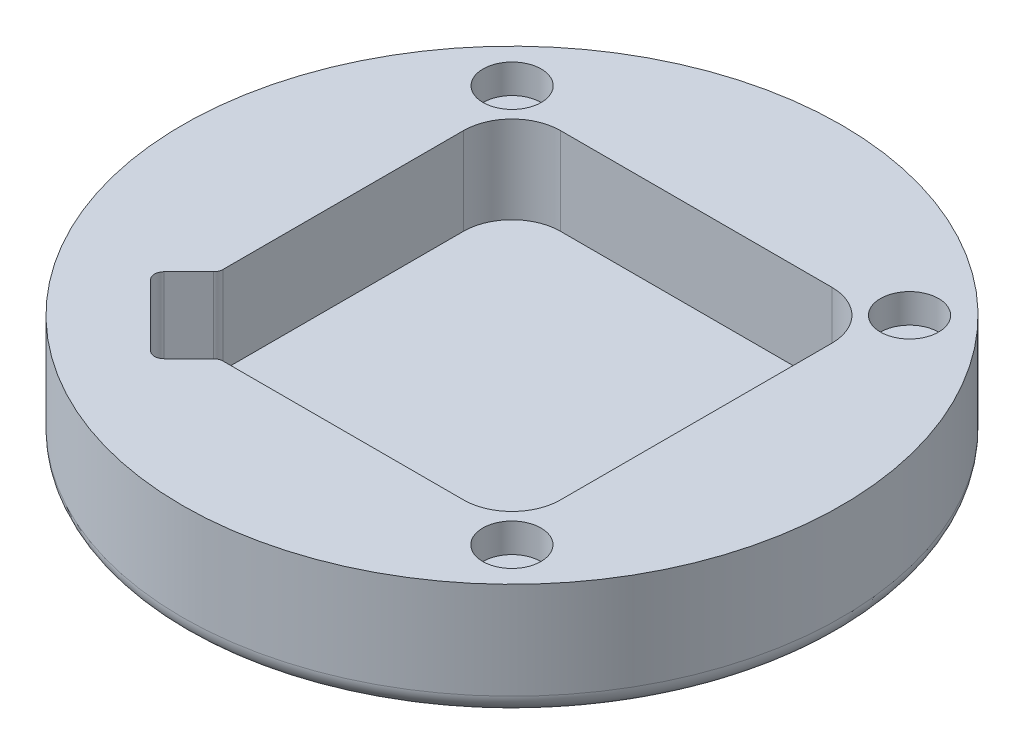
ISO-10303-21;
HEADER;
FILE_DESCRIPTION(('STEP AP214'),'2;1');
FILE_NAME('part.step','',(''),(''),'','','');
FILE_SCHEMA(('AUTOMOTIVE_DESIGN { 1 0 10303 214 1 1 1 1 }'));
ENDSEC;
DATA;
#1=APPLICATION_CONTEXT('core data for automotive mechanical design processes');
#2=APPLICATION_PROTOCOL_DEFINITION('international standard','automotive_design',2000,#1);
#3=PRODUCT_CONTEXT('',#1,'mechanical');
#4=PRODUCT('Part','Part','',(#3));
#5=PRODUCT_RELATED_PRODUCT_CATEGORY('part','',(#4));
#6=PRODUCT_DEFINITION_FORMATION('','',#4);
#7=PRODUCT_DEFINITION_CONTEXT('part definition',#1,'design');
#8=PRODUCT_DEFINITION('design','',#6,#7);
#9=PRODUCT_DEFINITION_SHAPE('','',#8);
#10=(LENGTH_UNIT() NAMED_UNIT(*) SI_UNIT(.MILLI.,.METRE.));
#11=(NAMED_UNIT(*) PLANE_ANGLE_UNIT() SI_UNIT($,.RADIAN.));
#12=(NAMED_UNIT(*) SI_UNIT($,.STERADIAN.) SOLID_ANGLE_UNIT());
#13=UNCERTAINTY_MEASURE_WITH_UNIT(LENGTH_MEASURE(1.E-05),#10,'distance_accuracy_value','');
#14=(GEOMETRIC_REPRESENTATION_CONTEXT(3) GLOBAL_UNCERTAINTY_ASSIGNED_CONTEXT((#13)) GLOBAL_UNIT_ASSIGNED_CONTEXT((#10,
#11,#12)) REPRESENTATION_CONTEXT('',''));
#15=CARTESIAN_POINT('',(0.,0.,0.));
#16=DIRECTION('',(0.,0.,1.));
#17=DIRECTION('',(1.,0.,0.));
#18=AXIS2_PLACEMENT_3D('',#15,#16,#17);
#19=CARTESIAN_POINT('',(0.,3.,0.));
#20=DIRECTION('',(0.,-1.,0.));
#21=DIRECTION('',(0.,0.,-1.));
#22=AXIS2_PLACEMENT_3D('',#19,#20,#21);
#23=CYLINDRICAL_SURFACE('',#22,34.);
#24=CARTESIAN_POINT('',(0.,2.,0.));
#25=DIRECTION('',(0.,1.,0.));
#26=DIRECTION('',(0.,0.,1.));
#27=AXIS2_PLACEMENT_3D('',#24,#25,#26);
#28=CIRCLE('',#27,34.);
#29=CARTESIAN_POINT('',(0.,2.,34.));
#30=VERTEX_POINT('',#29);
#31=EDGE_CURVE('E51',#30,#30,#28,.T.);
#32=ORIENTED_EDGE('',*,*,#31,.T.);
#33=EDGE_LOOP('',(#32));
#34=FACE_BOUND('',#33,.T.);
#35=CARTESIAN_POINT('',(0.,12.,0.));
#36=DIRECTION('',(0.,1.,0.));
#37=DIRECTION('',(0.,0.,1.));
#38=AXIS2_PLACEMENT_3D('',#35,#36,#37);
#39=CIRCLE('',#38,34.);
#40=CARTESIAN_POINT('',(0.,12.,34.));
#41=VERTEX_POINT('',#40);
#42=EDGE_CURVE('E178',#41,#41,#39,.T.);
#43=ORIENTED_EDGE('',*,*,#42,.F.);
#44=EDGE_LOOP('',(#43));
#45=FACE_BOUND('',#44,.T.);
#46=ADVANCED_FACE('F42',(#34,#45),#23,.T.);
#47=CARTESIAN_POINT('',(0.,0.,0.));
#48=DIRECTION('',(0.,1.,0.));
#49=DIRECTION('',(0.,0.,1.));
#50=AXIS2_PLACEMENT_3D('',#47,#48,#49);
#51=PLANE('',#50);
#52=CARTESIAN_POINT('',(0.,0.,0.));
#53=DIRECTION('',(0.,1.,0.));
#54=DIRECTION('',(0.,0.,1.));
#55=AXIS2_PLACEMENT_3D('',#52,#53,#54);
#56=CIRCLE('',#55,32.);
#57=CARTESIAN_POINT('',(0.,0.,32.));
#58=VERTEX_POINT('',#57);
#59=EDGE_CURVE('E11',#58,#58,#56,.F.);
#60=ORIENTED_EDGE('',*,*,#59,.T.);
#61=EDGE_LOOP('',(#60));
#62=FACE_BOUND('',#61,.T.);
#63=ADVANCED_FACE('F275',(#62),#51,.F.);
#64=CARTESIAN_POINT('',(0.,12.,0.));
#65=DIRECTION('',(0.,1.,0.));
#66=DIRECTION('',(0.,0.,1.));
#67=AXIS2_PLACEMENT_3D('',#64,#65,#66);
#68=PLANE('',#67);
#69=DIRECTION('',(-0.707106781186551,0.,0.707106781186543));
#70=VECTOR('',#69,1.);
#71=CARTESIAN_POINT('',(-19.,12.,11.2218254069479));
#72=LINE('',#71,#70);
#73=CARTESIAN_POINT('',(-19.2928932188135,12.,11.5147186257614));
#74=VERTEX_POINT('',#73);
#75=CARTESIAN_POINT('',(-21.8284271247462,12.,14.0502525316941));
#76=VERTEX_POINT('',#75);
#77=EDGE_CURVE('E332',#74,#76,#72,.T.);
#78=ORIENTED_EDGE('',*,*,#77,.F.);
#79=CARTESIAN_POINT('',(-20.,12.,10.8076118445748));
#80=DIRECTION('',(0.,1.,0.));
#81=DIRECTION('',(0.,0.,1.));
#82=AXIS2_PLACEMENT_3D('',#79,#80,#81);
#83=CIRCLE('',#82,1.);
#84=CARTESIAN_POINT('',(-19.,12.,10.8076118445748));
#85=VERTEX_POINT('',#84);
#86=EDGE_CURVE('E222',#74,#85,#83,.T.);
#87=ORIENTED_EDGE('',*,*,#86,.T.);
#88=DIRECTION('',(0.,0.,1.));
#89=VECTOR('',#88,1.);
#90=CARTESIAN_POINT('',(-19.,12.,19.));
#91=LINE('',#90,#89);
#92=CARTESIAN_POINT('',(-19.,12.,-14.));
#93=VERTEX_POINT('',#92);
#94=EDGE_CURVE('E369',#93,#85,#91,.T.);
#95=ORIENTED_EDGE('',*,*,#94,.F.);
#96=CARTESIAN_POINT('',(-14.,12.,-14.));
#97=DIRECTION('',(0.,1.,0.));
#98=DIRECTION('',(0.,0.,1.));
#99=AXIS2_PLACEMENT_3D('',#96,#97,#98);
#100=CIRCLE('',#99,5.);
#101=CARTESIAN_POINT('',(-14.,12.,-19.));
#102=VERTEX_POINT('',#101);
#103=EDGE_CURVE('E209',#93,#102,#100,.F.);
#104=ORIENTED_EDGE('',*,*,#103,.T.);
#105=DIRECTION('',(-1.,0.,0.));
#106=VECTOR('',#105,1.);
#107=CARTESIAN_POINT('',(-19.,12.,-19.));
#108=LINE('',#107,#106);
#109=CARTESIAN_POINT('',(14.,12.,-19.));
#110=VERTEX_POINT('',#109);
#111=EDGE_CURVE('E365',#110,#102,#108,.T.);
#112=ORIENTED_EDGE('',*,*,#111,.F.);
#113=CARTESIAN_POINT('',(14.,12.,-14.));
#114=DIRECTION('',(0.,1.,0.));
#115=DIRECTION('',(0.,0.,1.));
#116=AXIS2_PLACEMENT_3D('',#113,#114,#115);
#117=CIRCLE('',#116,5.);
#118=CARTESIAN_POINT('',(19.,12.,-14.));
#119=VERTEX_POINT('',#118);
#120=EDGE_CURVE('E206',#110,#119,#117,.F.);
#121=ORIENTED_EDGE('',*,*,#120,.T.);
#122=DIRECTION('',(0.,0.,-1.));
#123=VECTOR('',#122,1.);
#124=CARTESIAN_POINT('',(19.,12.,19.));
#125=LINE('',#124,#123);
#126=CARTESIAN_POINT('',(19.,12.,14.));
#127=VERTEX_POINT('',#126);
#128=EDGE_CURVE('E158',#127,#119,#125,.T.);
#129=ORIENTED_EDGE('',*,*,#128,.F.);
#130=CARTESIAN_POINT('',(14.,12.,14.));
#131=DIRECTION('',(0.,1.,0.));
#132=DIRECTION('',(0.,0.,1.));
#133=AXIS2_PLACEMENT_3D('',#130,#131,#132);
#134=CIRCLE('',#133,5.);
#135=CARTESIAN_POINT('',(14.,12.,19.));
#136=VERTEX_POINT('',#135);
#137=EDGE_CURVE('E203',#127,#136,#134,.F.);
#138=ORIENTED_EDGE('',*,*,#137,.T.);
#139=DIRECTION('',(1.,0.,0.));
#140=VECTOR('',#139,1.);
#141=CARTESIAN_POINT('',(-19.,12.,19.));
#142=LINE('',#141,#140);
#143=CARTESIAN_POINT('',(-10.8076118445749,12.,19.));
#144=VERTEX_POINT('',#143);
#145=EDGE_CURVE('E174',#144,#136,#142,.T.);
#146=ORIENTED_EDGE('',*,*,#145,.F.);
#147=CARTESIAN_POINT('',(-10.8076118445749,12.,20.));
#148=DIRECTION('',(0.,1.,0.));
#149=DIRECTION('',(0.,0.,1.));
#150=AXIS2_PLACEMENT_3D('',#147,#148,#149);
#151=CIRCLE('',#150,1.);
#152=CARTESIAN_POINT('',(-11.5147186257615,12.,19.2928932188134));
#153=VERTEX_POINT('',#152);
#154=EDGE_CURVE('E219',#144,#153,#151,.T.);
#155=ORIENTED_EDGE('',*,*,#154,.T.);
#156=DIRECTION('',(0.707106781186551,0.,-0.707106781186544));
#157=VECTOR('',#156,1.);
#158=CARTESIAN_POINT('',(-14.7573593128808,12.,22.5355339059327));
#159=LINE('',#158,#157);
#160=CARTESIAN_POINT('',(-14.0502525316942,12.,21.8284271247462));
#161=VERTEX_POINT('',#160);
#162=EDGE_CURVE('E339',#161,#153,#159,.T.);
#163=ORIENTED_EDGE('',*,*,#162,.F.);
#164=CARTESIAN_POINT('',(-14.7573593128808,12.,21.1213203435596));
#165=DIRECTION('',(0.,1.,0.));
#166=DIRECTION('',(0.,0.,1.));
#167=AXIS2_PLACEMENT_3D('',#164,#165,#166);
#168=CIRCLE('',#167,1.);
#169=CARTESIAN_POINT('',(-15.4644660940673,12.,21.8284271247462));
#170=VERTEX_POINT('',#169);
#171=EDGE_CURVE('E254',#161,#170,#168,.F.);
#172=ORIENTED_EDGE('',*,*,#171,.T.);
#173=DIRECTION('',(0.707106781186543,0.,0.707106781186552));
#174=VECTOR('',#173,1.);
#175=CARTESIAN_POINT('',(-17.1393577862369,12.,20.1535354325766));
#176=LINE('',#175,#174);
#177=CARTESIAN_POINT('',(-21.8284271247462,12.,15.4644660940672));
#178=VERTEX_POINT('',#177);
#179=EDGE_CURVE('E336',#178,#170,#176,.T.);
#180=ORIENTED_EDGE('',*,*,#179,.F.);
#181=CARTESIAN_POINT('',(-21.1213203435597,12.,14.7573593128807));
#182=DIRECTION('',(0.,1.,0.));
#183=DIRECTION('',(0.,0.,1.));
#184=AXIS2_PLACEMENT_3D('',#181,#182,#183);
#185=CIRCLE('',#184,1.);
#186=EDGE_CURVE('E257',#178,#76,#185,.F.);
#187=ORIENTED_EDGE('',*,*,#186,.T.);
#188=EDGE_LOOP('',(#78,#87,#95,#104,#112,#121,#129,#138,#146,#155,#163,#172,#180,#187));
#189=FACE_BOUND('',#188,.T.);
#190=CARTESIAN_POINT('',(-20.5,12.,-20.512191496766));
#191=DIRECTION('',(0.,1.,0.));
#192=DIRECTION('',(0.,0.,1.));
#193=AXIS2_PLACEMENT_3D('',#190,#191,#192);
#194=CIRCLE('',#193,3.);
#195=CARTESIAN_POINT('',(-20.5,12.,-17.512191496766));
#196=VERTEX_POINT('',#195);
#197=EDGE_CURVE('E347',#196,#196,#194,.T.);
#198=ORIENTED_EDGE('',*,*,#197,.F.);
#199=EDGE_LOOP('',(#198));
#200=FACE_BOUND('',#199,.T.);
#201=CARTESIAN_POINT('',(20.512191496766,12.,-20.5000000000017));
#202=DIRECTION('',(0.,1.,0.));
#203=DIRECTION('',(0.,0.,1.));
#204=AXIS2_PLACEMENT_3D('',#201,#202,#203);
#205=CIRCLE('',#204,3.00000000000175);
#206=CARTESIAN_POINT('',(20.512191496766,12.,-17.5));
#207=VERTEX_POINT('',#206);
#208=EDGE_CURVE('E351',#207,#207,#205,.T.);
#209=ORIENTED_EDGE('',*,*,#208,.F.);
#210=EDGE_LOOP('',(#209));
#211=FACE_BOUND('',#210,.T.);
#212=CARTESIAN_POINT('',(20.5000000000017,12.,20.5121914967643));
#213=DIRECTION('',(0.,1.,0.));
#214=DIRECTION('',(0.,0.,1.));
#215=AXIS2_PLACEMENT_3D('',#212,#213,#214);
#216=CIRCLE('',#215,3.00000000000235);
#217=CARTESIAN_POINT('',(20.5000000000017,12.,23.5121914967666));
#218=VERTEX_POINT('',#217);
#219=EDGE_CURVE('E326',#218,#218,#216,.T.);
#220=ORIENTED_EDGE('',*,*,#219,.F.);
#221=EDGE_LOOP('',(#220));
#222=FACE_BOUND('',#221,.T.);
#223=ORIENTED_EDGE('',*,*,#42,.T.);
#224=EDGE_LOOP('',(#223));
#225=FACE_BOUND('',#224,.T.);
#226=ADVANCED_FACE('F281',(#189,#200,#211,#222,#225),#68,.T.);
#227=CARTESIAN_POINT('',(19.,12.,19.));
#228=DIRECTION('',(-1.,0.,0.));
#229=DIRECTION('',(0.,0.,1.));
#230=AXIS2_PLACEMENT_3D('',#227,#228,#229);
#231=PLANE('',#230);
#232=DIRECTION('',(0.,0.,-1.));
#233=VECTOR('',#232,1.);
#234=CARTESIAN_POINT('',(19.,3.,19.));
#235=LINE('',#234,#233);
#236=CARTESIAN_POINT('',(19.,3.,14.));
#237=VERTEX_POINT('',#236);
#238=CARTESIAN_POINT('',(19.,3.,-14.));
#239=VERTEX_POINT('',#238);
#240=EDGE_CURVE('E346',#237,#239,#235,.T.);
#241=ORIENTED_EDGE('',*,*,#240,.F.);
#242=DIRECTION('',(0.,-1.,0.));
#243=VECTOR('',#242,1.);
#244=CARTESIAN_POINT('',(19.,12.,14.));
#245=LINE('',#244,#243);
#246=EDGE_CURVE('E167',#237,#127,#245,.F.);
#247=ORIENTED_EDGE('',*,*,#246,.T.);
#248=ORIENTED_EDGE('',*,*,#128,.T.);
#249=DIRECTION('',(0.,-1.,0.));
#250=VECTOR('',#249,1.);
#251=CARTESIAN_POINT('',(19.,3.,-14.));
#252=LINE('',#251,#250);
#253=EDGE_CURVE('E169',#119,#239,#252,.T.);
#254=ORIENTED_EDGE('',*,*,#253,.T.);
#255=EDGE_LOOP('',(#241,#247,#248,#254));
#256=FACE_BOUND('',#255,.T.);
#257=ADVANCED_FACE('F439',(#256),#231,.T.);
#258=CARTESIAN_POINT('',(-19.,12.,-19.));
#259=DIRECTION('',(0.,0.,1.));
#260=DIRECTION('',(1.,0.,0.));
#261=AXIS2_PLACEMENT_3D('',#258,#259,#260);
#262=PLANE('',#261);
#263=DIRECTION('',(-1.,0.,0.));
#264=VECTOR('',#263,1.);
#265=CARTESIAN_POINT('',(-19.,3.,-19.));
#266=LINE('',#265,#264);
#267=CARTESIAN_POINT('',(14.,3.,-19.));
#268=VERTEX_POINT('',#267);
#269=CARTESIAN_POINT('',(-14.,3.,-19.));
#270=VERTEX_POINT('',#269);
#271=EDGE_CURVE('E377',#268,#270,#266,.T.);
#272=ORIENTED_EDGE('',*,*,#271,.F.);
#273=DIRECTION('',(0.,-1.,0.));
#274=VECTOR('',#273,1.);
#275=CARTESIAN_POINT('',(14.,12.,-19.));
#276=LINE('',#275,#274);
#277=EDGE_CURVE('E200',#268,#110,#276,.F.);
#278=ORIENTED_EDGE('',*,*,#277,.T.);
#279=ORIENTED_EDGE('',*,*,#111,.T.);
#280=DIRECTION('',(0.,-1.,0.));
#281=VECTOR('',#280,1.);
#282=CARTESIAN_POINT('',(-14.,3.,-19.));
#283=LINE('',#282,#281);
#284=EDGE_CURVE('E196',#102,#270,#283,.T.);
#285=ORIENTED_EDGE('',*,*,#284,.T.);
#286=EDGE_LOOP('',(#272,#278,#279,#285));
#287=FACE_BOUND('',#286,.T.);
#288=ADVANCED_FACE('F436',(#287),#262,.T.);
#289=CARTESIAN_POINT('',(-19.,12.,19.));
#290=DIRECTION('',(1.,0.,0.));
#291=DIRECTION('',(0.,0.,-1.));
#292=AXIS2_PLACEMENT_3D('',#289,#290,#291);
#293=PLANE('',#292);
#294=ORIENTED_EDGE('',*,*,#94,.T.);
#295=DIRECTION('',(0.,1.,0.));
#296=VECTOR('',#295,1.);
#297=CARTESIAN_POINT('',(-19.,3.,10.8076118445748));
#298=LINE('',#297,#296);
#299=CARTESIAN_POINT('',(-19.,3.,10.8076118445748));
#300=VERTEX_POINT('',#299);
#301=EDGE_CURVE('E225',#85,#300,#298,.F.);
#302=ORIENTED_EDGE('',*,*,#301,.T.);
#303=DIRECTION('',(0.,0.,1.));
#304=VECTOR('',#303,1.);
#305=CARTESIAN_POINT('',(-19.,3.,19.));
#306=LINE('',#305,#304);
#307=CARTESIAN_POINT('',(-19.,3.,-14.));
#308=VERTEX_POINT('',#307);
#309=EDGE_CURVE('E159',#308,#300,#306,.T.);
#310=ORIENTED_EDGE('',*,*,#309,.F.);
#311=DIRECTION('',(0.,-1.,0.));
#312=VECTOR('',#311,1.);
#313=CARTESIAN_POINT('',(-19.,12.,-14.));
#314=LINE('',#313,#312);
#315=EDGE_CURVE('E193',#308,#93,#314,.F.);
#316=ORIENTED_EDGE('',*,*,#315,.T.);
#317=EDGE_LOOP('',(#294,#302,#310,#316));
#318=FACE_BOUND('',#317,.T.);
#319=ADVANCED_FACE('F433',(#318),#293,.T.);
#320=CARTESIAN_POINT('',(-19.,12.,19.));
#321=DIRECTION('',(0.,0.,-1.));
#322=DIRECTION('',(-1.,0.,0.));
#323=AXIS2_PLACEMENT_3D('',#320,#321,#322);
#324=PLANE('',#323);
#325=DIRECTION('',(1.,0.,0.));
#326=VECTOR('',#325,1.);
#327=CARTESIAN_POINT('',(-19.,3.,19.));
#328=LINE('',#327,#326);
#329=CARTESIAN_POINT('',(-10.8076118445749,3.,19.));
#330=VERTEX_POINT('',#329);
#331=CARTESIAN_POINT('',(14.,3.,19.));
#332=VERTEX_POINT('',#331);
#333=EDGE_CURVE('E144',#330,#332,#328,.T.);
#334=ORIENTED_EDGE('',*,*,#333,.F.);
#335=DIRECTION('',(0.,1.,0.));
#336=VECTOR('',#335,1.);
#337=CARTESIAN_POINT('',(-10.8076118445749,12.,19.));
#338=LINE('',#337,#336);
#339=EDGE_CURVE('E228',#330,#144,#338,.T.);
#340=ORIENTED_EDGE('',*,*,#339,.T.);
#341=ORIENTED_EDGE('',*,*,#145,.T.);
#342=DIRECTION('',(0.,-1.,0.));
#343=VECTOR('',#342,1.);
#344=CARTESIAN_POINT('',(14.,3.,19.));
#345=LINE('',#344,#343);
#346=EDGE_CURVE('E166',#136,#332,#345,.T.);
#347=ORIENTED_EDGE('',*,*,#346,.T.);
#348=EDGE_LOOP('',(#334,#340,#341,#347));
#349=FACE_BOUND('',#348,.T.);
#350=ADVANCED_FACE('F172',(#349),#324,.T.);
#351=CARTESIAN_POINT('',(0.,3.,0.));
#352=DIRECTION('',(0.,1.,0.));
#353=DIRECTION('',(0.,0.,1.));
#354=AXIS2_PLACEMENT_3D('',#351,#352,#353);
#355=PLANE('',#354);
#356=DIRECTION('',(0.707106781186544,0.,0.707106781186551));
#357=VECTOR('',#356,1.);
#358=CARTESIAN_POINT('',(-22.5355339059328,3.,14.7573593128807));
#359=LINE('',#358,#357);
#360=CARTESIAN_POINT('',(-21.8284271247462,3.,15.4644660940672));
#361=VERTEX_POINT('',#360);
#362=CARTESIAN_POINT('',(-15.4644660940673,3.,21.8284271247462));
#363=VERTEX_POINT('',#362);
#364=EDGE_CURVE('E314',#361,#363,#359,.T.);
#365=ORIENTED_EDGE('',*,*,#364,.T.);
#366=CARTESIAN_POINT('',(-14.7573593128808,3.,21.1213203435596));
#367=DIRECTION('',(0.,1.,0.));
#368=DIRECTION('',(0.,0.,1.));
#369=AXIS2_PLACEMENT_3D('',#366,#367,#368);
#370=CIRCLE('',#369,1.);
#371=CARTESIAN_POINT('',(-14.0502525316942,3.,21.8284271247462));
#372=VERTEX_POINT('',#371);
#373=EDGE_CURVE('E246',#363,#372,#370,.T.);
#374=ORIENTED_EDGE('',*,*,#373,.T.);
#375=DIRECTION('',(0.707106781186551,0.,-0.707106781186544));
#376=VECTOR('',#375,1.);
#377=CARTESIAN_POINT('',(-14.7573593128808,3.,22.5355339059327));
#378=LINE('',#377,#376);
#379=CARTESIAN_POINT('',(-11.5147186257615,3.,19.2928932188134));
#380=VERTEX_POINT('',#379);
#381=EDGE_CURVE('E313',#372,#380,#378,.T.);
#382=ORIENTED_EDGE('',*,*,#381,.T.);
#383=CARTESIAN_POINT('',(-10.8076118445749,3.,20.));
#384=DIRECTION('',(0.,1.,0.));
#385=DIRECTION('',(0.,0.,1.));
#386=AXIS2_PLACEMENT_3D('',#383,#384,#385);
#387=CIRCLE('',#386,1.);
#388=EDGE_CURVE('E152',#380,#330,#387,.F.);
#389=ORIENTED_EDGE('',*,*,#388,.T.);
#390=ORIENTED_EDGE('',*,*,#333,.T.);
#391=CARTESIAN_POINT('',(14.,3.,14.));
#392=DIRECTION('',(0.,1.,0.));
#393=DIRECTION('',(0.,0.,1.));
#394=AXIS2_PLACEMENT_3D('',#391,#392,#393);
#395=CIRCLE('',#394,5.);
#396=EDGE_CURVE('E148',#332,#237,#395,.T.);
#397=ORIENTED_EDGE('',*,*,#396,.T.);
#398=ORIENTED_EDGE('',*,*,#240,.T.);
#399=CARTESIAN_POINT('',(14.,3.,-14.));
#400=DIRECTION('',(0.,1.,0.));
#401=DIRECTION('',(0.,0.,1.));
#402=AXIS2_PLACEMENT_3D('',#399,#400,#401);
#403=CIRCLE('',#402,5.);
#404=EDGE_CURVE('E170',#239,#268,#403,.T.);
#405=ORIENTED_EDGE('',*,*,#404,.T.);
#406=ORIENTED_EDGE('',*,*,#271,.T.);
#407=CARTESIAN_POINT('',(-14.,3.,-14.));
#408=DIRECTION('',(0.,1.,0.));
#409=DIRECTION('',(0.,0.,1.));
#410=AXIS2_PLACEMENT_3D('',#407,#408,#409);
#411=CIRCLE('',#410,5.);
#412=EDGE_CURVE('E177',#270,#308,#411,.T.);
#413=ORIENTED_EDGE('',*,*,#412,.T.);
#414=ORIENTED_EDGE('',*,*,#309,.T.);
#415=CARTESIAN_POINT('',(-20.,3.,10.8076118445748));
#416=DIRECTION('',(0.,1.,0.));
#417=DIRECTION('',(0.,0.,1.));
#418=AXIS2_PLACEMENT_3D('',#415,#416,#417);
#419=CIRCLE('',#418,1.);
#420=CARTESIAN_POINT('',(-19.2928932188135,3.,11.5147186257614));
#421=VERTEX_POINT('',#420);
#422=EDGE_CURVE('E249',#300,#421,#419,.F.);
#423=ORIENTED_EDGE('',*,*,#422,.T.);
#424=DIRECTION('',(-0.707106781186551,0.,0.707106781186543));
#425=VECTOR('',#424,1.);
#426=CARTESIAN_POINT('',(-19.,3.,11.2218254069479));
#427=LINE('',#426,#425);
#428=CARTESIAN_POINT('',(-21.8284271247462,3.,14.0502525316941));
#429=VERTEX_POINT('',#428);
#430=EDGE_CURVE('E328',#421,#429,#427,.T.);
#431=ORIENTED_EDGE('',*,*,#430,.T.);
#432=CARTESIAN_POINT('',(-21.1213203435597,3.,14.7573593128807));
#433=DIRECTION('',(0.,1.,0.));
#434=DIRECTION('',(0.,0.,1.));
#435=AXIS2_PLACEMENT_3D('',#432,#433,#434);
#436=CIRCLE('',#435,1.);
#437=EDGE_CURVE('E65',#429,#361,#436,.T.);
#438=ORIENTED_EDGE('',*,*,#437,.T.);
#439=EDGE_LOOP('',(#365,#374,#382,#389,#390,#397,#398,#405,#406,#413,#414,#423,#431,#438));
#440=FACE_BOUND('',#439,.T.);
#441=ADVANCED_FACE('F146',(#440),#355,.T.);
#442=CARTESIAN_POINT('',(14.,12.,14.));
#443=DIRECTION('',(0.,1.,0.));
#444=DIRECTION('',(0.,0.,1.));
#445=AXIS2_PLACEMENT_3D('',#442,#443,#444);
#446=CYLINDRICAL_SURFACE('',#445,5.);
#447=ORIENTED_EDGE('',*,*,#137,.F.);
#448=ORIENTED_EDGE('',*,*,#246,.F.);
#449=ORIENTED_EDGE('',*,*,#396,.F.);
#450=ORIENTED_EDGE('',*,*,#346,.F.);
#451=EDGE_LOOP('',(#447,#448,#449,#450));
#452=FACE_BOUND('',#451,.T.);
#453=ADVANCED_FACE('F165',(#452),#446,.F.);
#454=CARTESIAN_POINT('',(14.,12.,-14.));
#455=DIRECTION('',(0.,1.,0.));
#456=DIRECTION('',(0.,0.,1.));
#457=AXIS2_PLACEMENT_3D('',#454,#455,#456);
#458=CYLINDRICAL_SURFACE('',#457,5.);
#459=ORIENTED_EDGE('',*,*,#120,.F.);
#460=ORIENTED_EDGE('',*,*,#277,.F.);
#461=ORIENTED_EDGE('',*,*,#404,.F.);
#462=ORIENTED_EDGE('',*,*,#253,.F.);
#463=EDGE_LOOP('',(#459,#460,#461,#462));
#464=FACE_BOUND('',#463,.T.);
#465=ADVANCED_FACE('F288',(#464),#458,.F.);
#466=CARTESIAN_POINT('',(-14.,12.,-14.));
#467=DIRECTION('',(0.,1.,0.));
#468=DIRECTION('',(0.,0.,1.));
#469=AXIS2_PLACEMENT_3D('',#466,#467,#468);
#470=CYLINDRICAL_SURFACE('',#469,5.);
#471=ORIENTED_EDGE('',*,*,#103,.F.);
#472=ORIENTED_EDGE('',*,*,#315,.F.);
#473=ORIENTED_EDGE('',*,*,#412,.F.);
#474=ORIENTED_EDGE('',*,*,#284,.F.);
#475=EDGE_LOOP('',(#471,#472,#473,#474));
#476=FACE_BOUND('',#475,.T.);
#477=ADVANCED_FACE('F291',(#476),#470,.F.);
#478=CARTESIAN_POINT('',(20.5000000000017,9.,20.5121914967643));
#479=DIRECTION('',(0.,1.,0.));
#480=DIRECTION('',(0.,0.,1.));
#481=AXIS2_PLACEMENT_3D('',#478,#479,#480);
#482=CYLINDRICAL_SURFACE('',#481,3.00000000000235);
#483=CARTESIAN_POINT('',(20.5000000000017,9.,20.5121914967643));
#484=DIRECTION('',(0.,1.,0.));
#485=DIRECTION('',(0.,0.,1.));
#486=AXIS2_PLACEMENT_3D('',#483,#484,#485);
#487=CIRCLE('',#486,3.00000000000235);
#488=CARTESIAN_POINT('',(20.5000000000017,9.,23.5121914967666));
#489=VERTEX_POINT('',#488);
#490=EDGE_CURVE('E321',#489,#489,#487,.T.);
#491=ORIENTED_EDGE('',*,*,#490,.F.);
#492=EDGE_LOOP('',(#491));
#493=FACE_BOUND('',#492,.T.);
#494=ORIENTED_EDGE('',*,*,#219,.T.);
#495=EDGE_LOOP('',(#494));
#496=FACE_BOUND('',#495,.T.);
#497=ADVANCED_FACE('F295',(#493,#496),#482,.F.);
#498=CARTESIAN_POINT('',(20.5000000000017,9.,20.5121914967643));
#499=DIRECTION('',(0.,1.,0.));
#500=DIRECTION('',(0.,0.,1.));
#501=AXIS2_PLACEMENT_3D('',#498,#499,#500);
#502=PLANE('',#501);
#503=ORIENTED_EDGE('',*,*,#490,.T.);
#504=EDGE_LOOP('',(#503));
#505=FACE_BOUND('',#504,.T.);
#506=ADVANCED_FACE('F420',(#505),#502,.T.);
#507=CARTESIAN_POINT('',(20.512191496766,9.,-20.5000000000017));
#508=DIRECTION('',(0.,1.,0.));
#509=DIRECTION('',(0.,0.,1.));
#510=AXIS2_PLACEMENT_3D('',#507,#508,#509);
#511=CYLINDRICAL_SURFACE('',#510,3.00000000000175);
#512=CARTESIAN_POINT('',(20.512191496766,9.,-20.5000000000017));
#513=DIRECTION('',(0.,1.,0.));
#514=DIRECTION('',(0.,0.,1.));
#515=AXIS2_PLACEMENT_3D('',#512,#513,#514);
#516=CIRCLE('',#515,3.00000000000175);
#517=CARTESIAN_POINT('',(20.512191496766,9.,-17.5));
#518=VERTEX_POINT('',#517);
#519=EDGE_CURVE('E355',#518,#518,#516,.T.);
#520=ORIENTED_EDGE('',*,*,#519,.F.);
#521=EDGE_LOOP('',(#520));
#522=FACE_BOUND('',#521,.T.);
#523=ORIENTED_EDGE('',*,*,#208,.T.);
#524=EDGE_LOOP('',(#523));
#525=FACE_BOUND('',#524,.T.);
#526=ADVANCED_FACE('F417',(#522,#525),#511,.F.);
#527=CARTESIAN_POINT('',(20.512191496766,9.,-20.5000000000017));
#528=DIRECTION('',(0.,1.,0.));
#529=DIRECTION('',(0.,0.,1.));
#530=AXIS2_PLACEMENT_3D('',#527,#528,#529);
#531=PLANE('',#530);
#532=ORIENTED_EDGE('',*,*,#519,.T.);
#533=EDGE_LOOP('',(#532));
#534=FACE_BOUND('',#533,.T.);
#535=ADVANCED_FACE('F415',(#534),#531,.T.);
#536=CARTESIAN_POINT('',(-20.5,9.,-20.512191496766));
#537=DIRECTION('',(0.,1.,0.));
#538=DIRECTION('',(0.,0.,1.));
#539=AXIS2_PLACEMENT_3D('',#536,#537,#538);
#540=CYLINDRICAL_SURFACE('',#539,3.);
#541=CARTESIAN_POINT('',(-20.5,9.,-20.512191496766));
#542=DIRECTION('',(0.,1.,0.));
#543=DIRECTION('',(0.,0.,1.));
#544=AXIS2_PLACEMENT_3D('',#541,#542,#543);
#545=CIRCLE('',#544,3.);
#546=CARTESIAN_POINT('',(-20.5,9.,-17.512191496766));
#547=VERTEX_POINT('',#546);
#548=EDGE_CURVE('E342',#547,#547,#545,.T.);
#549=ORIENTED_EDGE('',*,*,#548,.F.);
#550=EDGE_LOOP('',(#549));
#551=FACE_BOUND('',#550,.T.);
#552=ORIENTED_EDGE('',*,*,#197,.T.);
#553=EDGE_LOOP('',(#552));
#554=FACE_BOUND('',#553,.T.);
#555=ADVANCED_FACE('F411',(#551,#554),#540,.F.);
#556=CARTESIAN_POINT('',(-20.5,9.,-20.512191496766));
#557=DIRECTION('',(0.,1.,0.));
#558=DIRECTION('',(0.,0.,1.));
#559=AXIS2_PLACEMENT_3D('',#556,#557,#558);
#560=PLANE('',#559);
#561=ORIENTED_EDGE('',*,*,#548,.T.);
#562=EDGE_LOOP('',(#561));
#563=FACE_BOUND('',#562,.T.);
#564=ADVANCED_FACE('F406',(#563),#560,.T.);
#565=CARTESIAN_POINT('',(-14.7573593128808,3.,22.5355339059327));
#566=DIRECTION('',(0.707106781186544,0.,0.707106781186551));
#567=DIRECTION('',(0.707106781186551,0.,-0.707106781186544));
#568=AXIS2_PLACEMENT_3D('',#565,#566,#567);
#569=PLANE('',#568);
#570=ORIENTED_EDGE('',*,*,#162,.T.);
#571=DIRECTION('',(0.,1.,0.));
#572=VECTOR('',#571,1.);
#573=CARTESIAN_POINT('',(-11.5147186257615,3.,19.2928932188134));
#574=LINE('',#573,#572);
#575=EDGE_CURVE('E235',#153,#380,#574,.F.);
#576=ORIENTED_EDGE('',*,*,#575,.T.);
#577=ORIENTED_EDGE('',*,*,#381,.F.);
#578=DIRECTION('',(0.,1.,0.));
#579=VECTOR('',#578,1.);
#580=CARTESIAN_POINT('',(-14.0502525316942,12.,21.8284271247462));
#581=LINE('',#580,#579);
#582=EDGE_CURVE('E231',#372,#161,#581,.T.);
#583=ORIENTED_EDGE('',*,*,#582,.T.);
#584=EDGE_LOOP('',(#570,#576,#577,#583));
#585=FACE_BOUND('',#584,.T.);
#586=ADVANCED_FACE('F317',(#585),#569,.F.);
#587=CARTESIAN_POINT('',(-17.1393577862369,3.,20.1535354325766));
#588=DIRECTION('',(-0.707106781186552,0.,0.707106781186543));
#589=DIRECTION('',(0.707106781186543,0.,0.707106781186552));
#590=AXIS2_PLACEMENT_3D('',#587,#588,#589);
#591=PLANE('',#590);
#592=ORIENTED_EDGE('',*,*,#179,.T.);
#593=DIRECTION('',(0.,1.,0.));
#594=VECTOR('',#593,1.);
#595=CARTESIAN_POINT('',(-15.4644660940673,3.,21.8284271247462));
#596=LINE('',#595,#594);
#597=EDGE_CURVE('E58',#170,#363,#596,.F.);
#598=ORIENTED_EDGE('',*,*,#597,.T.);
#599=ORIENTED_EDGE('',*,*,#364,.F.);
#600=DIRECTION('',(0.,1.,0.));
#601=VECTOR('',#600,1.);
#602=CARTESIAN_POINT('',(-21.8284271247462,12.,15.4644660940672));
#603=LINE('',#602,#601);
#604=EDGE_CURVE('E238',#361,#178,#603,.T.);
#605=ORIENTED_EDGE('',*,*,#604,.T.);
#606=EDGE_LOOP('',(#592,#598,#599,#605));
#607=FACE_BOUND('',#606,.T.);
#608=ADVANCED_FACE('F398',(#607),#591,.F.);
#609=CARTESIAN_POINT('',(-19.,3.,11.2218254069479));
#610=DIRECTION('',(-0.707106781186544,0.,-0.707106781186552));
#611=DIRECTION('',(-0.707106781186552,0.,0.707106781186544));
#612=AXIS2_PLACEMENT_3D('',#609,#610,#611);
#613=PLANE('',#612);
#614=ORIENTED_EDGE('',*,*,#430,.F.);
#615=DIRECTION('',(0.,1.,0.));
#616=VECTOR('',#615,1.);
#617=CARTESIAN_POINT('',(-19.2928932188135,12.,11.5147186257614));
#618=LINE('',#617,#616);
#619=EDGE_CURVE('E215',#421,#74,#618,.T.);
#620=ORIENTED_EDGE('',*,*,#619,.T.);
#621=ORIENTED_EDGE('',*,*,#77,.T.);
#622=DIRECTION('',(0.,1.,0.));
#623=VECTOR('',#622,1.);
#624=CARTESIAN_POINT('',(-21.8284271247462,3.,14.0502525316941));
#625=LINE('',#624,#623);
#626=EDGE_CURVE('E212',#76,#429,#625,.F.);
#627=ORIENTED_EDGE('',*,*,#626,.T.);
#628=EDGE_LOOP('',(#614,#620,#621,#627));
#629=FACE_BOUND('',#628,.T.);
#630=ADVANCED_FACE('F301',(#629),#613,.F.);
#631=CARTESIAN_POINT('',(-20.,3.,10.8076118445748));
#632=DIRECTION('',(0.,-1.,0.));
#633=DIRECTION('',(0.,0.,-1.));
#634=AXIS2_PLACEMENT_3D('',#631,#632,#633);
#635=CYLINDRICAL_SURFACE('',#634,1.);
#636=ORIENTED_EDGE('',*,*,#422,.F.);
#637=ORIENTED_EDGE('',*,*,#301,.F.);
#638=ORIENTED_EDGE('',*,*,#86,.F.);
#639=ORIENTED_EDGE('',*,*,#619,.F.);
#640=EDGE_LOOP('',(#636,#637,#638,#639));
#641=FACE_BOUND('',#640,.T.);
#642=ADVANCED_FACE('F297',(#641),#635,.T.);
#643=CARTESIAN_POINT('',(-10.8076118445749,12.,20.));
#644=DIRECTION('',(0.,-1.,0.));
#645=DIRECTION('',(0.,0.,-1.));
#646=AXIS2_PLACEMENT_3D('',#643,#644,#645);
#647=CYLINDRICAL_SURFACE('',#646,1.);
#648=ORIENTED_EDGE('',*,*,#388,.F.);
#649=ORIENTED_EDGE('',*,*,#575,.F.);
#650=ORIENTED_EDGE('',*,*,#154,.F.);
#651=ORIENTED_EDGE('',*,*,#339,.F.);
#652=EDGE_LOOP('',(#648,#649,#650,#651));
#653=FACE_BOUND('',#652,.T.);
#654=ADVANCED_FACE('F300',(#653),#647,.T.);
#655=CARTESIAN_POINT('',(-14.7573593128808,3.,21.1213203435596));
#656=DIRECTION('',(0.,-1.,0.));
#657=DIRECTION('',(0.,0.,-1.));
#658=AXIS2_PLACEMENT_3D('',#655,#656,#657);
#659=CYLINDRICAL_SURFACE('',#658,1.);
#660=ORIENTED_EDGE('',*,*,#373,.F.);
#661=ORIENTED_EDGE('',*,*,#597,.F.);
#662=ORIENTED_EDGE('',*,*,#171,.F.);
#663=ORIENTED_EDGE('',*,*,#582,.F.);
#664=EDGE_LOOP('',(#660,#661,#662,#663));
#665=FACE_BOUND('',#664,.T.);
#666=ADVANCED_FACE('F271',(#665),#659,.F.);
#667=CARTESIAN_POINT('',(-21.1213203435597,3.,14.7573593128807));
#668=DIRECTION('',(0.,-1.,0.));
#669=DIRECTION('',(0.,0.,-1.));
#670=AXIS2_PLACEMENT_3D('',#667,#668,#669);
#671=CYLINDRICAL_SURFACE('',#670,1.);
#672=ORIENTED_EDGE('',*,*,#437,.F.);
#673=ORIENTED_EDGE('',*,*,#626,.F.);
#674=ORIENTED_EDGE('',*,*,#186,.F.);
#675=ORIENTED_EDGE('',*,*,#604,.F.);
#676=EDGE_LOOP('',(#672,#673,#674,#675));
#677=FACE_BOUND('',#676,.T.);
#678=ADVANCED_FACE('F266',(#677),#671,.F.);
#679=CARTESIAN_POINT('',(0.,2.,0.));
#680=DIRECTION('',(0.,1.,0.));
#681=DIRECTION('',(0.,0.,1.));
#682=AXIS2_PLACEMENT_3D('',#679,#680,#681);
#683=TOROIDAL_SURFACE('',#682,32.,2.);
#684=ORIENTED_EDGE('',*,*,#59,.F.);
#685=EDGE_LOOP('',(#684));
#686=FACE_BOUND('',#685,.T.);
#687=ORIENTED_EDGE('',*,*,#31,.F.);
#688=EDGE_LOOP('',(#687));
#689=FACE_BOUND('',#688,.T.);
#690=ADVANCED_FACE('F44',(#686,#689),#683,.T.);
#691=CLOSED_SHELL('',(#46,#63,#226,#257,#288,#319,#350,#441,#453,#465,#477,#497,#506,#526,#535,
#555,#564,#586,#608,#630,#642,#654,#666,#678,#690));
#692=MANIFOLD_SOLID_BREP('B2',#691);
#693=ADVANCED_BREP_SHAPE_REPRESENTATION('',(#18,#692),#14);
#694=SHAPE_DEFINITION_REPRESENTATION(#9,#693);
ENDSEC;
END-ISO-10303-21;
